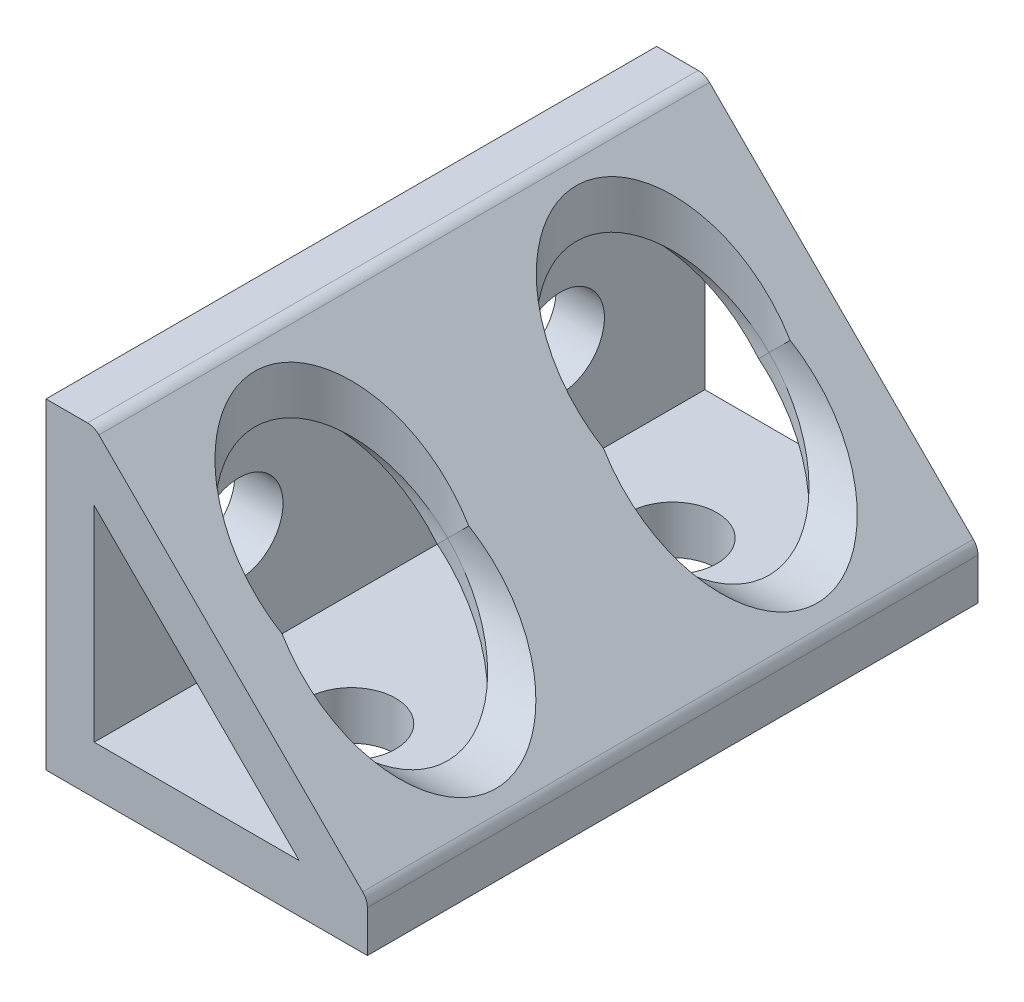
ISO-10303-21;
HEADER;
FILE_DESCRIPTION(('STEP AP214'),'2;1');
FILE_NAME('part.step','',(''),(''),'','','');
FILE_SCHEMA(('AUTOMOTIVE_DESIGN { 1 0 10303 214 1 1 1 1 }'));
ENDSEC;
DATA;
#1=APPLICATION_CONTEXT('core data for automotive mechanical design processes');
#2=APPLICATION_PROTOCOL_DEFINITION('international standard','automotive_design',2000,#1);
#3=PRODUCT_CONTEXT('',#1,'mechanical');
#4=PRODUCT('Part','Part','',(#3));
#5=PRODUCT_RELATED_PRODUCT_CATEGORY('part','',(#4));
#6=PRODUCT_DEFINITION_FORMATION('','',#4);
#7=PRODUCT_DEFINITION_CONTEXT('part definition',#1,'design');
#8=PRODUCT_DEFINITION('design','',#6,#7);
#9=PRODUCT_DEFINITION_SHAPE('','',#8);
#10=(LENGTH_UNIT() NAMED_UNIT(*) SI_UNIT(.MILLI.,.METRE.));
#11=(NAMED_UNIT(*) PLANE_ANGLE_UNIT() SI_UNIT($,.RADIAN.));
#12=(NAMED_UNIT(*) SI_UNIT($,.STERADIAN.) SOLID_ANGLE_UNIT());
#13=UNCERTAINTY_MEASURE_WITH_UNIT(LENGTH_MEASURE(1.E-05),#10,'distance_accuracy_value','');
#14=(GEOMETRIC_REPRESENTATION_CONTEXT(3) GLOBAL_UNCERTAINTY_ASSIGNED_CONTEXT((#13)) GLOBAL_UNIT_ASSIGNED_CONTEXT((#10,
#11,#12)) REPRESENTATION_CONTEXT('',''));
#15=CARTESIAN_POINT('',(0.,0.,0.));
#16=DIRECTION('',(0.,0.,1.));
#17=DIRECTION('',(1.,0.,0.));
#18=AXIS2_PLACEMENT_3D('',#15,#16,#17);
#19=CARTESIAN_POINT('',(0.,0.,19.));
#20=DIRECTION('',(0.,0.,-1.));
#21=DIRECTION('',(-1.,0.,0.));
#22=AXIS2_PLACEMENT_3D('',#19,#20,#21);
#23=PLANE('',#22);
#24=DIRECTION('',(-0.707106781186548,0.707106781186547,0.));
#25=VECTOR('',#24,1.);
#26=CARTESIAN_POINT('',(15.7573593128807,3.,19.));
#27=LINE('',#26,#25);
#28=CARTESIAN_POINT('',(15.7573593128807,2.99999999999999,19.));
#29=VERTEX_POINT('',#28);
#30=CARTESIAN_POINT('',(3.,15.7573593128807,19.));
#31=VERTEX_POINT('',#30);
#32=EDGE_CURVE('E326',#29,#31,#27,.T.);
#33=ORIENTED_EDGE('',*,*,#32,.F.);
#34=DIRECTION('',(-1.,0.,0.));
#35=VECTOR('',#34,1.);
#36=CARTESIAN_POINT('',(0.,2.99999999999999,19.));
#37=LINE('',#36,#35);
#38=CARTESIAN_POINT('',(3.,2.99999999999999,19.));
#39=VERTEX_POINT('',#38);
#40=EDGE_CURVE('E212',#29,#39,#37,.T.);
#41=ORIENTED_EDGE('',*,*,#40,.T.);
#42=DIRECTION('',(0.,1.,0.));
#43=VECTOR('',#42,1.);
#44=CARTESIAN_POINT('',(3.,20.,19.));
#45=LINE('',#44,#43);
#46=EDGE_CURVE('E219',#39,#31,#45,.T.);
#47=ORIENTED_EDGE('',*,*,#46,.T.);
#48=EDGE_LOOP('',(#33,#41,#47));
#49=FACE_BOUND('',#48,.T.);
#50=DIRECTION('',(0.,1.,0.));
#51=VECTOR('',#50,1.);
#52=CARTESIAN_POINT('',(20.,0.,19.));
#53=LINE('',#52,#51);
#54=CARTESIAN_POINT('',(20.,0.,19.));
#55=VERTEX_POINT('',#54);
#56=CARTESIAN_POINT('',(20.,2.58578643762691,19.));
#57=VERTEX_POINT('',#56);
#58=EDGE_CURVE('E198',#55,#57,#53,.T.);
#59=ORIENTED_EDGE('',*,*,#58,.T.);
#60=CARTESIAN_POINT('',(19.,2.58578643762691,19.));
#61=DIRECTION('',(0.,0.,-1.));
#62=DIRECTION('',(-1.,0.,0.));
#63=AXIS2_PLACEMENT_3D('',#60,#61,#62);
#64=CIRCLE('',#63,1.);
#65=CARTESIAN_POINT('',(19.7071067811865,3.29289321881346,19.));
#66=VERTEX_POINT('',#65);
#67=EDGE_CURVE('E296',#57,#66,#64,.F.);
#68=ORIENTED_EDGE('',*,*,#67,.T.);
#69=DIRECTION('',(0.707106781186547,-0.707106781186547,0.));
#70=VECTOR('',#69,1.);
#71=CARTESIAN_POINT('',(3.29289321881345,19.7071067811866,19.));
#72=LINE('',#71,#70);
#73=CARTESIAN_POINT('',(3.29289321881345,19.7071067811866,19.));
#74=VERTEX_POINT('',#73);
#75=EDGE_CURVE('E246',#74,#66,#72,.T.);
#76=ORIENTED_EDGE('',*,*,#75,.F.);
#77=CARTESIAN_POINT('',(2.5857864376269,19.,19.));
#78=DIRECTION('',(0.,0.,-1.));
#79=DIRECTION('',(-1.,0.,0.));
#80=AXIS2_PLACEMENT_3D('',#77,#78,#79);
#81=CIRCLE('',#80,1.);
#82=CARTESIAN_POINT('',(2.5857864376269,20.,19.));
#83=VERTEX_POINT('',#82);
#84=EDGE_CURVE('E294',#74,#83,#81,.F.);
#85=ORIENTED_EDGE('',*,*,#84,.T.);
#86=DIRECTION('',(1.,0.,0.));
#87=VECTOR('',#86,1.);
#88=CARTESIAN_POINT('',(0.,20.,19.));
#89=LINE('',#88,#87);
#90=CARTESIAN_POINT('',(0.,20.,19.));
#91=VERTEX_POINT('',#90);
#92=EDGE_CURVE('E237',#91,#83,#89,.T.);
#93=ORIENTED_EDGE('',*,*,#92,.F.);
#94=DIRECTION('',(0.,1.,0.));
#95=VECTOR('',#94,1.);
#96=CARTESIAN_POINT('',(0.,20.,19.));
#97=LINE('',#96,#95);
#98=CARTESIAN_POINT('',(0.,0.,19.));
#99=VERTEX_POINT('',#98);
#100=EDGE_CURVE('E224',#99,#91,#97,.T.);
#101=ORIENTED_EDGE('',*,*,#100,.F.);
#102=DIRECTION('',(-1.,0.,0.));
#103=VECTOR('',#102,1.);
#104=CARTESIAN_POINT('',(0.,0.,19.));
#105=LINE('',#104,#103);
#106=EDGE_CURVE('E202',#55,#99,#105,.T.);
#107=ORIENTED_EDGE('',*,*,#106,.F.);
#108=EDGE_LOOP('',(#59,#68,#76,#85,#93,#101,#107));
#109=FACE_BOUND('',#108,.T.);
#110=ADVANCED_FACE('F51',(#49,#109),#23,.F.);
#111=CARTESIAN_POINT('',(0.,0.,-19.));
#112=DIRECTION('',(0.,0.,-1.));
#113=DIRECTION('',(-1.,0.,0.));
#114=AXIS2_PLACEMENT_3D('',#111,#112,#113);
#115=PLANE('',#114);
#116=DIRECTION('',(0.707106781186547,-0.707106781186547,0.));
#117=VECTOR('',#116,1.);
#118=CARTESIAN_POINT('',(3.29289321881345,19.7071067811866,-19.));
#119=LINE('',#118,#117);
#120=CARTESIAN_POINT('',(3.29289321881345,19.7071067811866,-19.));
#121=VERTEX_POINT('',#120);
#122=CARTESIAN_POINT('',(19.7071067811865,3.29289321881346,-19.));
#123=VERTEX_POINT('',#122);
#124=EDGE_CURVE('E240',#121,#123,#119,.T.);
#125=ORIENTED_EDGE('',*,*,#124,.T.);
#126=CARTESIAN_POINT('',(19.,2.58578643762691,-19.));
#127=DIRECTION('',(0.,0.,-1.));
#128=DIRECTION('',(-1.,0.,0.));
#129=AXIS2_PLACEMENT_3D('',#126,#127,#128);
#130=CIRCLE('',#129,1.);
#131=CARTESIAN_POINT('',(20.,2.58578643762691,-19.));
#132=VERTEX_POINT('',#131);
#133=EDGE_CURVE('E59',#123,#132,#130,.T.);
#134=ORIENTED_EDGE('',*,*,#133,.T.);
#135=DIRECTION('',(0.,1.,0.));
#136=VECTOR('',#135,1.);
#137=CARTESIAN_POINT('',(20.,0.,-19.));
#138=LINE('',#137,#136);
#139=CARTESIAN_POINT('',(20.,0.,-19.));
#140=VERTEX_POINT('',#139);
#141=EDGE_CURVE('E195',#140,#132,#138,.T.);
#142=ORIENTED_EDGE('',*,*,#141,.F.);
#143=DIRECTION('',(1.,0.,0.));
#144=VECTOR('',#143,1.);
#145=CARTESIAN_POINT('',(20.,0.,-19.));
#146=LINE('',#145,#144);
#147=CARTESIAN_POINT('',(0.,0.,-19.));
#148=VERTEX_POINT('',#147);
#149=EDGE_CURVE('E203',#148,#140,#146,.T.);
#150=ORIENTED_EDGE('',*,*,#149,.F.);
#151=DIRECTION('',(0.,-1.,0.));
#152=VECTOR('',#151,1.);
#153=CARTESIAN_POINT('',(0.,2.99999999999999,-19.));
#154=LINE('',#153,#152);
#155=CARTESIAN_POINT('',(0.,20.,-19.));
#156=VERTEX_POINT('',#155);
#157=EDGE_CURVE('E229',#156,#148,#154,.T.);
#158=ORIENTED_EDGE('',*,*,#157,.F.);
#159=DIRECTION('',(1.,0.,0.));
#160=VECTOR('',#159,1.);
#161=CARTESIAN_POINT('',(0.,20.,-19.));
#162=LINE('',#161,#160);
#163=CARTESIAN_POINT('',(2.5857864376269,20.,-19.));
#164=VERTEX_POINT('',#163);
#165=EDGE_CURVE('E230',#156,#164,#162,.T.);
#166=ORIENTED_EDGE('',*,*,#165,.T.);
#167=CARTESIAN_POINT('',(2.5857864376269,19.,-19.));
#168=DIRECTION('',(0.,0.,-1.));
#169=DIRECTION('',(-1.,0.,0.));
#170=AXIS2_PLACEMENT_3D('',#167,#168,#169);
#171=CIRCLE('',#170,1.);
#172=EDGE_CURVE('E302',#164,#121,#171,.T.);
#173=ORIENTED_EDGE('',*,*,#172,.T.);
#174=EDGE_LOOP('',(#125,#134,#142,#150,#158,#166,#173));
#175=FACE_BOUND('',#174,.T.);
#176=DIRECTION('',(-0.707106781186548,0.707106781186547,0.));
#177=VECTOR('',#176,1.);
#178=CARTESIAN_POINT('',(15.7573593128807,3.,-19.));
#179=LINE('',#178,#177);
#180=CARTESIAN_POINT('',(15.7573593128807,3.,-19.));
#181=VERTEX_POINT('',#180);
#182=CARTESIAN_POINT('',(3.,15.7573593128807,-19.));
#183=VERTEX_POINT('',#182);
#184=EDGE_CURVE('E245',#181,#183,#179,.T.);
#185=ORIENTED_EDGE('',*,*,#184,.T.);
#186=DIRECTION('',(0.,-1.,0.));
#187=VECTOR('',#186,1.);
#188=CARTESIAN_POINT('',(3.,2.99999999999999,-19.));
#189=LINE('',#188,#187);
#190=CARTESIAN_POINT('',(3.,2.99999999999999,-19.));
#191=VERTEX_POINT('',#190);
#192=EDGE_CURVE('E227',#183,#191,#189,.T.);
#193=ORIENTED_EDGE('',*,*,#192,.T.);
#194=DIRECTION('',(1.,0.,0.));
#195=VECTOR('',#194,1.);
#196=CARTESIAN_POINT('',(20.,2.99999999999999,-19.));
#197=LINE('',#196,#195);
#198=EDGE_CURVE('E318',#191,#181,#197,.T.);
#199=ORIENTED_EDGE('',*,*,#198,.T.);
#200=EDGE_LOOP('',(#185,#193,#199));
#201=FACE_BOUND('',#200,.T.);
#202=ADVANCED_FACE('F214',(#175,#201),#115,.T.);
#203=CARTESIAN_POINT('',(10.,20.,10.));
#204=DIRECTION('',(0.,-1.,0.));
#205=DIRECTION('',(1.,0.,0.));
#206=AXIS2_PLACEMENT_3D('',#203,#204,#205);
#207=CYLINDRICAL_SURFACE('',#206,6.);
#208=CARTESIAN_POINT('',(10.,10.,10.));
#209=DIRECTION('',(-0.707106781186548,-0.707106781186547,0.));
#210=DIRECTION('',(0.707106781186547,-0.707106781186548,0.));
#211=AXIS2_PLACEMENT_3D('',#208,#209,#210);
#212=ELLIPSE('',#211,8.48528137423857,6.);
#213=CARTESIAN_POINT('',(10.,10.,16.));
#214=VERTEX_POINT('',#213);
#215=CARTESIAN_POINT('',(10.,10.,4.));
#216=VERTEX_POINT('',#215);
#217=EDGE_CURVE('E412',#214,#216,#212,.F.);
#218=ORIENTED_EDGE('',*,*,#217,.T.);
#219=CARTESIAN_POINT('',(10.,10.,10.));
#220=DIRECTION('',(0.707106781186547,-0.707106781186548,0.));
#221=DIRECTION('',(-0.707106781186548,-0.707106781186547,0.));
#222=AXIS2_PLACEMENT_3D('',#219,#220,#221);
#223=ELLIPSE('',#222,8.48528137423857,6.);
#224=CARTESIAN_POINT('',(9.37867965644037,9.37867965644034,4.03225662157973));
#225=VERTEX_POINT('',#224);
#226=EDGE_CURVE('E284',#216,#225,#223,.F.);
#227=ORIENTED_EDGE('',*,*,#226,.T.);
#228=CARTESIAN_POINT('',(10.,8.75735931288071,10.));
#229=DIRECTION('',(0.707106781186547,0.707106781186548,0.));
#230=DIRECTION('',(0.707106781186548,-0.707106781186547,0.));
#231=AXIS2_PLACEMENT_3D('',#228,#229,#230);
#232=ELLIPSE('',#231,8.48528137423857,6.);
#233=CARTESIAN_POINT('',(15.7573593128807,2.99999999999999,8.31097254540202));
#234=VERTEX_POINT('',#233);
#235=EDGE_CURVE('E277',#225,#234,#232,.F.);
#236=ORIENTED_EDGE('',*,*,#235,.T.);
#237=CARTESIAN_POINT('',(10.,3.,10.));
#238=DIRECTION('',(0.,-1.,0.));
#239=DIRECTION('',(1.,0.,0.));
#240=AXIS2_PLACEMENT_3D('',#237,#238,#239);
#241=CIRCLE('',#240,6.);
#242=CARTESIAN_POINT('',(15.7573593128807,2.99999999999999,11.689027454598));
#243=VERTEX_POINT('',#242);
#244=EDGE_CURVE('E239',#243,#234,#241,.F.);
#245=ORIENTED_EDGE('',*,*,#244,.F.);
#246=CARTESIAN_POINT('',(10.,8.75735931288071,10.));
#247=DIRECTION('',(0.707106781186547,0.707106781186548,0.));
#248=DIRECTION('',(0.707106781186548,-0.707106781186547,0.));
#249=AXIS2_PLACEMENT_3D('',#246,#247,#248);
#250=ELLIPSE('',#249,8.48528137423857,6.);
#251=CARTESIAN_POINT('',(9.37867965644038,9.37867965644033,15.9677433784203));
#252=VERTEX_POINT('',#251);
#253=EDGE_CURVE('E349',#243,#252,#250,.F.);
#254=ORIENTED_EDGE('',*,*,#253,.T.);
#255=CARTESIAN_POINT('',(10.,10.,10.));
#256=DIRECTION('',(0.707106781186547,-0.707106781186548,0.));
#257=DIRECTION('',(-0.707106781186548,-0.707106781186547,0.));
#258=AXIS2_PLACEMENT_3D('',#255,#256,#257);
#259=ELLIPSE('',#258,8.48528137423857,6.);
#260=EDGE_CURVE('E287',#252,#214,#259,.F.);
#261=ORIENTED_EDGE('',*,*,#260,.T.);
#262=EDGE_LOOP('',(#218,#227,#236,#245,#254,#261));
#263=FACE_BOUND('',#262,.T.);
#264=ADVANCED_FACE('F463',(#263),#207,.F.);
#265=CARTESIAN_POINT('',(20.,10.,10.));
#266=DIRECTION('',(-1.,0.,0.));
#267=DIRECTION('',(0.,-1.,0.));
#268=AXIS2_PLACEMENT_3D('',#265,#266,#267);
#269=CYLINDRICAL_SURFACE('',#268,6.);
#270=ORIENTED_EDGE('',*,*,#226,.F.);
#271=CARTESIAN_POINT('',(10.,10.,10.));
#272=DIRECTION('',(-0.707106781186548,-0.707106781186547,0.));
#273=DIRECTION('',(-0.707106781186547,0.707106781186548,0.));
#274=AXIS2_PLACEMENT_3D('',#271,#272,#273);
#275=ELLIPSE('',#274,8.48528137423857,6.);
#276=EDGE_CURVE('E423',#216,#214,#275,.F.);
#277=ORIENTED_EDGE('',*,*,#276,.T.);
#278=ORIENTED_EDGE('',*,*,#260,.F.);
#279=CARTESIAN_POINT('',(8.75735931288071,10.,10.));
#280=DIRECTION('',(0.707106781186547,0.707106781186548,0.));
#281=DIRECTION('',(-0.707106781186548,0.707106781186547,0.));
#282=AXIS2_PLACEMENT_3D('',#279,#280,#281);
#283=ELLIPSE('',#282,8.48528137423857,6.);
#284=CARTESIAN_POINT('',(3.,15.7573593128807,11.689027454598));
#285=VERTEX_POINT('',#284);
#286=EDGE_CURVE('E341',#252,#285,#283,.F.);
#287=ORIENTED_EDGE('',*,*,#286,.T.);
#288=CARTESIAN_POINT('',(3.,10.,10.));
#289=DIRECTION('',(-1.,0.,0.));
#290=DIRECTION('',(0.,-1.,0.));
#291=AXIS2_PLACEMENT_3D('',#288,#289,#290);
#292=CIRCLE('',#291,6.);
#293=CARTESIAN_POINT('',(3.,15.7573593128807,8.31097254540202));
#294=VERTEX_POINT('',#293);
#295=EDGE_CURVE('E336',#285,#294,#292,.T.);
#296=ORIENTED_EDGE('',*,*,#295,.T.);
#297=CARTESIAN_POINT('',(8.75735931288071,10.,10.));
#298=DIRECTION('',(0.707106781186547,0.707106781186548,0.));
#299=DIRECTION('',(-0.707106781186548,0.707106781186547,0.));
#300=AXIS2_PLACEMENT_3D('',#297,#298,#299);
#301=ELLIPSE('',#300,8.48528137423857,6.);
#302=EDGE_CURVE('E280',#294,#225,#301,.F.);
#303=ORIENTED_EDGE('',*,*,#302,.T.);
#304=EDGE_LOOP('',(#270,#277,#278,#287,#296,#303));
#305=FACE_BOUND('',#304,.T.);
#306=ADVANCED_FACE('F466',(#305),#269,.F.);
#307=CARTESIAN_POINT('',(3.,15.7573593128807,-19.));
#308=DIRECTION('',(0.707106781186547,0.707106781186548,0.));
#309=DIRECTION('',(-0.707106781186548,0.707106781186547,0.));
#310=AXIS2_PLACEMENT_3D('',#307,#308,#309);
#311=PLANE('',#310);
#312=CARTESIAN_POINT('',(10.,8.75735931288071,-10.));
#313=DIRECTION('',(0.707106781186547,0.707106781186548,0.));
#314=DIRECTION('',(0.707106781186548,-0.707106781186547,0.));
#315=AXIS2_PLACEMENT_3D('',#312,#313,#314);
#316=ELLIPSE('',#315,8.48528137423857,6.);
#317=CARTESIAN_POINT('',(15.7573593128807,2.99999999999999,-8.31097254540202));
#318=VERTEX_POINT('',#317);
#319=CARTESIAN_POINT('',(9.37867965644038,9.37867965644033,-4.03225662157974));
#320=VERTEX_POINT('',#319);
#321=EDGE_CURVE('E273',#318,#320,#316,.F.);
#322=ORIENTED_EDGE('',*,*,#321,.F.);
#323=DIRECTION('',(0.,0.,1.));
#324=VECTOR('',#323,1.);
#325=CARTESIAN_POINT('',(15.7573593128807,3.,-19.));
#326=LINE('',#325,#324);
#327=EDGE_CURVE('E388',#318,#234,#326,.T.);
#328=ORIENTED_EDGE('',*,*,#327,.T.);
#329=ORIENTED_EDGE('',*,*,#235,.F.);
#330=ORIENTED_EDGE('',*,*,#302,.F.);
#331=DIRECTION('',(0.,0.,1.));
#332=VECTOR('',#331,1.);
#333=CARTESIAN_POINT('',(3.,15.7573593128807,-19.));
#334=LINE('',#333,#332);
#335=CARTESIAN_POINT('',(3.,15.7573593128807,-8.31097254540201));
#336=VERTEX_POINT('',#335);
#337=EDGE_CURVE('E347',#294,#336,#334,.F.);
#338=ORIENTED_EDGE('',*,*,#337,.T.);
#339=CARTESIAN_POINT('',(8.75735931288071,10.,-10.));
#340=DIRECTION('',(0.707106781186547,0.707106781186548,0.));
#341=DIRECTION('',(-0.707106781186548,0.707106781186547,0.));
#342=AXIS2_PLACEMENT_3D('',#339,#340,#341);
#343=ELLIPSE('',#342,8.48528137423857,6.);
#344=EDGE_CURVE('E266',#336,#320,#343,.T.);
#345=ORIENTED_EDGE('',*,*,#344,.T.);
#346=EDGE_LOOP('',(#322,#328,#329,#330,#338,#345));
#347=FACE_BOUND('',#346,.T.);
#348=ADVANCED_FACE('F472',(#347),#311,.F.);
#349=CARTESIAN_POINT('',(10.,20.,-10.));
#350=DIRECTION('',(0.,-1.,0.));
#351=DIRECTION('',(1.,0.,0.));
#352=AXIS2_PLACEMENT_3D('',#349,#350,#351);
#353=CYLINDRICAL_SURFACE('',#352,6.);
#354=CARTESIAN_POINT('',(10.,10.,-10.));
#355=DIRECTION('',(-0.707106781186548,-0.707106781186547,0.));
#356=DIRECTION('',(0.707106781186547,-0.707106781186548,0.));
#357=AXIS2_PLACEMENT_3D('',#354,#355,#356);
#358=ELLIPSE('',#357,8.48528137423857,6.);
#359=CARTESIAN_POINT('',(10.,10.,-4.));
#360=VERTEX_POINT('',#359);
#361=CARTESIAN_POINT('',(10.,10.,-16.));
#362=VERTEX_POINT('',#361);
#363=EDGE_CURVE('E397',#360,#362,#358,.F.);
#364=ORIENTED_EDGE('',*,*,#363,.T.);
#365=CARTESIAN_POINT('',(10.,10.,-10.));
#366=DIRECTION('',(0.707106781186547,-0.707106781186548,0.));
#367=DIRECTION('',(-0.707106781186548,-0.707106781186547,0.));
#368=AXIS2_PLACEMENT_3D('',#365,#366,#367);
#369=ELLIPSE('',#368,8.48528137423857,6.);
#370=CARTESIAN_POINT('',(9.37867965644037,9.37867965644034,-15.9677433784203));
#371=VERTEX_POINT('',#370);
#372=EDGE_CURVE('E426',#362,#371,#369,.F.);
#373=ORIENTED_EDGE('',*,*,#372,.T.);
#374=CARTESIAN_POINT('',(10.,8.75735931288071,-10.));
#375=DIRECTION('',(0.707106781186547,0.707106781186548,0.));
#376=DIRECTION('',(0.707106781186548,-0.707106781186547,0.));
#377=AXIS2_PLACEMENT_3D('',#374,#375,#376);
#378=ELLIPSE('',#377,8.48528137423857,6.);
#379=CARTESIAN_POINT('',(15.7573593128807,2.99999999999999,-11.689027454598));
#380=VERTEX_POINT('',#379);
#381=EDGE_CURVE('E380',#371,#380,#378,.F.);
#382=ORIENTED_EDGE('',*,*,#381,.T.);
#383=CARTESIAN_POINT('',(10.,3.,-10.));
#384=DIRECTION('',(0.,-1.,0.));
#385=DIRECTION('',(1.,0.,0.));
#386=AXIS2_PLACEMENT_3D('',#383,#384,#385);
#387=CIRCLE('',#386,6.);
#388=EDGE_CURVE('E384',#380,#318,#387,.T.);
#389=ORIENTED_EDGE('',*,*,#388,.T.);
#390=ORIENTED_EDGE('',*,*,#321,.T.);
#391=CARTESIAN_POINT('',(10.,10.,-10.));
#392=DIRECTION('',(0.707106781186547,-0.707106781186548,0.));
#393=DIRECTION('',(-0.707106781186548,-0.707106781186547,0.));
#394=AXIS2_PLACEMENT_3D('',#391,#392,#393);
#395=ELLIPSE('',#394,8.48528137423857,6.);
#396=EDGE_CURVE('E272',#320,#360,#395,.F.);
#397=ORIENTED_EDGE('',*,*,#396,.T.);
#398=EDGE_LOOP('',(#364,#373,#382,#389,#390,#397));
#399=FACE_BOUND('',#398,.T.);
#400=ADVANCED_FACE('F436',(#399),#353,.F.);
#401=CARTESIAN_POINT('',(20.,10.,-10.));
#402=DIRECTION('',(-1.,0.,0.));
#403=DIRECTION('',(0.,-1.,0.));
#404=AXIS2_PLACEMENT_3D('',#401,#402,#403);
#405=CYLINDRICAL_SURFACE('',#404,6.);
#406=ORIENTED_EDGE('',*,*,#372,.F.);
#407=CARTESIAN_POINT('',(10.,10.,-10.));
#408=DIRECTION('',(-0.707106781186548,-0.707106781186547,0.));
#409=DIRECTION('',(-0.707106781186547,0.707106781186548,0.));
#410=AXIS2_PLACEMENT_3D('',#407,#408,#409);
#411=ELLIPSE('',#410,8.48528137423857,6.);
#412=EDGE_CURVE('E408',#362,#360,#411,.F.);
#413=ORIENTED_EDGE('',*,*,#412,.T.);
#414=ORIENTED_EDGE('',*,*,#396,.F.);
#415=ORIENTED_EDGE('',*,*,#344,.F.);
#416=CARTESIAN_POINT('',(3.,10.,-10.));
#417=DIRECTION('',(-1.,0.,0.));
#418=DIRECTION('',(0.,-1.,0.));
#419=AXIS2_PLACEMENT_3D('',#416,#417,#418);
#420=CIRCLE('',#419,6.);
#421=CARTESIAN_POINT('',(3.,15.7573593128807,-11.689027454598));
#422=VERTEX_POINT('',#421);
#423=EDGE_CURVE('E389',#336,#422,#420,.T.);
#424=ORIENTED_EDGE('',*,*,#423,.T.);
#425=CARTESIAN_POINT('',(8.75735931288071,10.,-10.));
#426=DIRECTION('',(0.707106781186547,0.707106781186548,0.));
#427=DIRECTION('',(-0.707106781186548,0.707106781186547,0.));
#428=AXIS2_PLACEMENT_3D('',#425,#426,#427);
#429=ELLIPSE('',#428,8.48528137423857,6.);
#430=EDGE_CURVE('E375',#422,#371,#429,.F.);
#431=ORIENTED_EDGE('',*,*,#430,.T.);
#432=EDGE_LOOP('',(#406,#413,#414,#415,#424,#431));
#433=FACE_BOUND('',#432,.T.);
#434=ADVANCED_FACE('F442',(#433),#405,.F.);
#435=CARTESIAN_POINT('',(10.,20.,10.));
#436=DIRECTION('',(0.,-1.,0.));
#437=DIRECTION('',(1.,0.,0.));
#438=AXIS2_PLACEMENT_3D('',#435,#436,#437);
#439=CYLINDRICAL_SURFACE('',#438,6.);
#440=ORIENTED_EDGE('',*,*,#276,.F.);
#441=CARTESIAN_POINT('',(10.,10.,10.));
#442=DIRECTION('',(0.707106781186547,-0.707106781186548,0.));
#443=DIRECTION('',(-0.707106781186548,-0.707106781186547,0.));
#444=AXIS2_PLACEMENT_3D('',#441,#442,#443);
#445=ELLIPSE('',#444,8.48528137423857,6.);
#446=CARTESIAN_POINT('',(11.5,11.5,4.19052498068887));
#447=VERTEX_POINT('',#446);
#448=EDGE_CURVE('E419',#216,#447,#445,.T.);
#449=ORIENTED_EDGE('',*,*,#448,.T.);
#450=CARTESIAN_POINT('',(10.,13.,10.));
#451=DIRECTION('',(0.707106781186548,0.707106781186548,0.));
#452=DIRECTION('',(0.707106781186548,-0.707106781186548,0.));
#453=AXIS2_PLACEMENT_3D('',#450,#451,#452);
#454=ELLIPSE('',#453,8.48528137423857,6.);
#455=CARTESIAN_POINT('',(11.5,11.5,15.8094750193111));
#456=VERTEX_POINT('',#455);
#457=EDGE_CURVE('E371',#456,#447,#454,.F.);
#458=ORIENTED_EDGE('',*,*,#457,.F.);
#459=CARTESIAN_POINT('',(10.,10.,10.));
#460=DIRECTION('',(0.707106781186547,-0.707106781186548,0.));
#461=DIRECTION('',(-0.707106781186548,-0.707106781186547,0.));
#462=AXIS2_PLACEMENT_3D('',#459,#460,#461);
#463=ELLIPSE('',#462,8.48528137423857,6.);
#464=EDGE_CURVE('E415',#456,#214,#463,.T.);
#465=ORIENTED_EDGE('',*,*,#464,.T.);
#466=EDGE_LOOP('',(#440,#449,#458,#465));
#467=FACE_BOUND('',#466,.T.);
#468=ADVANCED_FACE('F456',(#467),#439,.F.);
#469=CARTESIAN_POINT('',(20.,10.,10.));
#470=DIRECTION('',(-1.,0.,0.));
#471=DIRECTION('',(0.,-1.,0.));
#472=AXIS2_PLACEMENT_3D('',#469,#470,#471);
#473=CYLINDRICAL_SURFACE('',#472,6.);
#474=CARTESIAN_POINT('',(13.,10.,10.));
#475=DIRECTION('',(0.707106781186548,0.707106781186548,0.));
#476=DIRECTION('',(-0.707106781186548,0.707106781186548,0.));
#477=AXIS2_PLACEMENT_3D('',#474,#475,#476);
#478=ELLIPSE('',#477,8.48528137423857,6.);
#479=EDGE_CURVE('E367',#447,#456,#478,.F.);
#480=ORIENTED_EDGE('',*,*,#479,.F.);
#481=ORIENTED_EDGE('',*,*,#448,.F.);
#482=ORIENTED_EDGE('',*,*,#217,.F.);
#483=ORIENTED_EDGE('',*,*,#464,.F.);
#484=EDGE_LOOP('',(#480,#481,#482,#483));
#485=FACE_BOUND('',#484,.T.);
#486=ADVANCED_FACE('F460',(#485),#473,.F.);
#487=CARTESIAN_POINT('',(10.,20.,-10.));
#488=DIRECTION('',(0.,-1.,0.));
#489=DIRECTION('',(1.,0.,0.));
#490=AXIS2_PLACEMENT_3D('',#487,#488,#489);
#491=CYLINDRICAL_SURFACE('',#490,6.);
#492=ORIENTED_EDGE('',*,*,#412,.F.);
#493=CARTESIAN_POINT('',(10.,10.,-10.));
#494=DIRECTION('',(0.707106781186547,-0.707106781186548,0.));
#495=DIRECTION('',(-0.707106781186548,-0.707106781186547,0.));
#496=AXIS2_PLACEMENT_3D('',#493,#494,#495);
#497=ELLIPSE('',#496,8.48528137423857,6.);
#498=CARTESIAN_POINT('',(11.5,11.5,-15.8094750193111));
#499=VERTEX_POINT('',#498);
#500=EDGE_CURVE('E404',#362,#499,#497,.T.);
#501=ORIENTED_EDGE('',*,*,#500,.T.);
#502=CARTESIAN_POINT('',(10.,13.,-10.));
#503=DIRECTION('',(0.707106781186548,0.707106781186548,0.));
#504=DIRECTION('',(0.707106781186548,-0.707106781186548,0.));
#505=AXIS2_PLACEMENT_3D('',#502,#503,#504);
#506=ELLIPSE('',#505,8.48528137423857,6.);
#507=CARTESIAN_POINT('',(11.5,11.5,-4.19052498068887));
#508=VERTEX_POINT('',#507);
#509=EDGE_CURVE('E363',#508,#499,#506,.F.);
#510=ORIENTED_EDGE('',*,*,#509,.F.);
#511=CARTESIAN_POINT('',(10.,10.,-10.));
#512=DIRECTION('',(0.707106781186547,-0.707106781186548,0.));
#513=DIRECTION('',(-0.707106781186548,-0.707106781186547,0.));
#514=AXIS2_PLACEMENT_3D('',#511,#512,#513);
#515=ELLIPSE('',#514,8.48528137423857,6.);
#516=EDGE_CURVE('E400',#508,#360,#515,.T.);
#517=ORIENTED_EDGE('',*,*,#516,.T.);
#518=EDGE_LOOP('',(#492,#501,#510,#517));
#519=FACE_BOUND('',#518,.T.);
#520=ADVANCED_FACE('F446',(#519),#491,.F.);
#521=CARTESIAN_POINT('',(20.,10.,-10.));
#522=DIRECTION('',(-1.,0.,0.));
#523=DIRECTION('',(0.,-1.,0.));
#524=AXIS2_PLACEMENT_3D('',#521,#522,#523);
#525=CYLINDRICAL_SURFACE('',#524,6.);
#526=CARTESIAN_POINT('',(13.,10.,-10.));
#527=DIRECTION('',(0.707106781186548,0.707106781186548,0.));
#528=DIRECTION('',(-0.707106781186548,0.707106781186548,0.));
#529=AXIS2_PLACEMENT_3D('',#526,#527,#528);
#530=ELLIPSE('',#529,8.48528137423857,6.);
#531=EDGE_CURVE('E359',#499,#508,#530,.F.);
#532=ORIENTED_EDGE('',*,*,#531,.F.);
#533=ORIENTED_EDGE('',*,*,#500,.F.);
#534=ORIENTED_EDGE('',*,*,#363,.F.);
#535=ORIENTED_EDGE('',*,*,#516,.F.);
#536=EDGE_LOOP('',(#532,#533,#534,#535));
#537=FACE_BOUND('',#536,.T.);
#538=ADVANCED_FACE('F448',(#537),#525,.F.);
#539=CARTESIAN_POINT('',(3.,15.7573593128807,-19.));
#540=DIRECTION('',(0.707106781186547,0.707106781186548,0.));
#541=DIRECTION('',(-0.707106781186548,0.707106781186547,0.));
#542=AXIS2_PLACEMENT_3D('',#539,#540,#541);
#543=PLANE('',#542);
#544=ORIENTED_EDGE('',*,*,#253,.F.);
#545=DIRECTION('',(0.,0.,1.));
#546=VECTOR('',#545,1.);
#547=CARTESIAN_POINT('',(15.7573593128807,3.,-19.));
#548=LINE('',#547,#546);
#549=EDGE_CURVE('E383',#243,#29,#548,.T.);
#550=ORIENTED_EDGE('',*,*,#549,.T.);
#551=ORIENTED_EDGE('',*,*,#32,.T.);
#552=DIRECTION('',(0.,0.,1.));
#553=VECTOR('',#552,1.);
#554=CARTESIAN_POINT('',(3.,15.7573593128807,-19.));
#555=LINE('',#554,#553);
#556=EDGE_CURVE('E334',#31,#285,#555,.F.);
#557=ORIENTED_EDGE('',*,*,#556,.T.);
#558=ORIENTED_EDGE('',*,*,#286,.F.);
#559=EDGE_LOOP('',(#544,#550,#551,#557,#558));
#560=FACE_BOUND('',#559,.T.);
#561=ADVANCED_FACE('F475',(#560),#543,.F.);
#562=CARTESIAN_POINT('',(3.,15.7573593128807,-19.));
#563=DIRECTION('',(0.707106781186547,0.707106781186548,0.));
#564=DIRECTION('',(-0.707106781186548,0.707106781186547,0.));
#565=AXIS2_PLACEMENT_3D('',#562,#563,#564);
#566=PLANE('',#565);
#567=DIRECTION('',(0.,0.,1.));
#568=VECTOR('',#567,1.);
#569=CARTESIAN_POINT('',(3.,15.7573593128807,-19.));
#570=LINE('',#569,#568);
#571=EDGE_CURVE('E379',#183,#422,#570,.T.);
#572=ORIENTED_EDGE('',*,*,#571,.F.);
#573=ORIENTED_EDGE('',*,*,#184,.F.);
#574=DIRECTION('',(0.,0.,1.));
#575=VECTOR('',#574,1.);
#576=CARTESIAN_POINT('',(15.7573593128807,3.,-19.));
#577=LINE('',#576,#575);
#578=EDGE_CURVE('E382',#380,#181,#577,.F.);
#579=ORIENTED_EDGE('',*,*,#578,.F.);
#580=ORIENTED_EDGE('',*,*,#381,.F.);
#581=ORIENTED_EDGE('',*,*,#430,.F.);
#582=EDGE_LOOP('',(#572,#573,#579,#580,#581));
#583=FACE_BOUND('',#582,.T.);
#584=ADVANCED_FACE('F451',(#583),#566,.F.);
#585=CARTESIAN_POINT('',(3.,20.,-19.));
#586=DIRECTION('',(0.707106781186548,0.707106781186548,0.));
#587=DIRECTION('',(-0.707106781186548,0.707106781186548,0.));
#588=AXIS2_PLACEMENT_3D('',#585,#586,#587);
#589=PLANE('',#588);
#590=ORIENTED_EDGE('',*,*,#75,.T.);
#591=DIRECTION('',(0.,0.,1.));
#592=VECTOR('',#591,1.);
#593=CARTESIAN_POINT('',(19.7071067811865,3.29289321881345,-19.));
#594=LINE('',#593,#592);
#595=EDGE_CURVE('E72',#66,#123,#594,.F.);
#596=ORIENTED_EDGE('',*,*,#595,.T.);
#597=ORIENTED_EDGE('',*,*,#124,.F.);
#598=DIRECTION('',(0.,0.,1.));
#599=VECTOR('',#598,1.);
#600=CARTESIAN_POINT('',(3.29289321881345,19.7071067811865,19.));
#601=LINE('',#600,#599);
#602=EDGE_CURVE('E298',#121,#74,#601,.T.);
#603=ORIENTED_EDGE('',*,*,#602,.T.);
#604=EDGE_LOOP('',(#590,#596,#597,#603));
#605=FACE_BOUND('',#604,.T.);
#606=ORIENTED_EDGE('',*,*,#509,.T.);
#607=ORIENTED_EDGE('',*,*,#531,.T.);
#608=EDGE_LOOP('',(#606,#607));
#609=FACE_BOUND('',#608,.T.);
#610=ORIENTED_EDGE('',*,*,#457,.T.);
#611=ORIENTED_EDGE('',*,*,#479,.T.);
#612=EDGE_LOOP('',(#610,#611));
#613=FACE_BOUND('',#612,.T.);
#614=ADVANCED_FACE('F306',(#605,#609,#613),#589,.T.);
#615=CARTESIAN_POINT('',(3.,0.,0.));
#616=DIRECTION('',(1.,0.,0.));
#617=DIRECTION('',(0.,0.,-1.));
#618=AXIS2_PLACEMENT_3D('',#615,#616,#617);
#619=PLANE('',#618);
#620=CARTESIAN_POINT('',(3.,10.,10.));
#621=DIRECTION('',(-1.,0.,0.));
#622=DIRECTION('',(0.,0.,1.));
#623=AXIS2_PLACEMENT_3D('',#620,#621,#622);
#624=CIRCLE('',#623,2.74999999999999);
#625=CARTESIAN_POINT('',(3.,10.,12.75));
#626=VERTEX_POINT('',#625);
#627=EDGE_CURVE('E648',#626,#626,#624,.T.);
#628=ORIENTED_EDGE('',*,*,#627,.T.);
#629=EDGE_LOOP('',(#628));
#630=FACE_BOUND('',#629,.T.);
#631=CARTESIAN_POINT('',(3.,10.,-10.));
#632=DIRECTION('',(-1.,0.,0.));
#633=DIRECTION('',(0.,0.,1.));
#634=AXIS2_PLACEMENT_3D('',#631,#632,#633);
#635=CIRCLE('',#634,2.74999999999999);
#636=CARTESIAN_POINT('',(3.,10.,-7.25000000000001));
#637=VERTEX_POINT('',#636);
#638=EDGE_CURVE('E663',#637,#637,#635,.T.);
#639=ORIENTED_EDGE('',*,*,#638,.T.);
#640=EDGE_LOOP('',(#639));
#641=FACE_BOUND('',#640,.T.);
#642=ORIENTED_EDGE('',*,*,#556,.F.);
#643=ORIENTED_EDGE('',*,*,#46,.F.);
#644=DIRECTION('',(0.,0.,1.));
#645=VECTOR('',#644,1.);
#646=CARTESIAN_POINT('',(3.,2.99999999999999,19.));
#647=LINE('',#646,#645);
#648=EDGE_CURVE('E217',#191,#39,#647,.T.);
#649=ORIENTED_EDGE('',*,*,#648,.F.);
#650=ORIENTED_EDGE('',*,*,#192,.F.);
#651=ORIENTED_EDGE('',*,*,#571,.T.);
#652=ORIENTED_EDGE('',*,*,#423,.F.);
#653=ORIENTED_EDGE('',*,*,#337,.F.);
#654=ORIENTED_EDGE('',*,*,#295,.F.);
#655=EDGE_LOOP('',(#642,#643,#649,#650,#651,#652,#653,#654));
#656=FACE_BOUND('',#655,.T.);
#657=ADVANCED_FACE('F332',(#630,#641,#656),#619,.T.);
#658=CARTESIAN_POINT('',(0.,20.,-19.));
#659=DIRECTION('',(0.,-1.,0.));
#660=DIRECTION('',(0.,0.,-1.));
#661=AXIS2_PLACEMENT_3D('',#658,#659,#660);
#662=PLANE('',#661);
#663=ORIENTED_EDGE('',*,*,#92,.T.);
#664=DIRECTION('',(0.,0.,1.));
#665=VECTOR('',#664,1.);
#666=CARTESIAN_POINT('',(2.5857864376269,20.,-19.));
#667=LINE('',#666,#665);
#668=EDGE_CURVE('E12',#83,#164,#667,.F.);
#669=ORIENTED_EDGE('',*,*,#668,.T.);
#670=ORIENTED_EDGE('',*,*,#165,.F.);
#671=DIRECTION('',(0.,0.,-1.));
#672=VECTOR('',#671,1.);
#673=CARTESIAN_POINT('',(0.,20.,-19.));
#674=LINE('',#673,#672);
#675=EDGE_CURVE('E226',#91,#156,#674,.T.);
#676=ORIENTED_EDGE('',*,*,#675,.F.);
#677=EDGE_LOOP('',(#663,#669,#670,#676));
#678=FACE_BOUND('',#677,.T.);
#679=ADVANCED_FACE('F312',(#678),#662,.F.);
#680=CARTESIAN_POINT('',(0.,0.,0.));
#681=DIRECTION('',(1.,0.,0.));
#682=DIRECTION('',(0.,0.,-1.));
#683=AXIS2_PLACEMENT_3D('',#680,#681,#682);
#684=PLANE('',#683);
#685=CARTESIAN_POINT('',(0.,10.,10.));
#686=DIRECTION('',(-1.,0.,0.));
#687=DIRECTION('',(0.,0.,1.));
#688=AXIS2_PLACEMENT_3D('',#685,#686,#687);
#689=CIRCLE('',#688,2.74999999999999);
#690=CARTESIAN_POINT('',(0.,10.,12.75));
#691=VERTEX_POINT('',#690);
#692=EDGE_CURVE('E651',#691,#691,#689,.T.);
#693=ORIENTED_EDGE('',*,*,#692,.F.);
#694=EDGE_LOOP('',(#693));
#695=FACE_BOUND('',#694,.T.);
#696=CARTESIAN_POINT('',(0.,10.,-10.));
#697=DIRECTION('',(-1.,0.,0.));
#698=DIRECTION('',(0.,0.,1.));
#699=AXIS2_PLACEMENT_3D('',#696,#697,#698);
#700=CIRCLE('',#699,2.74999999999999);
#701=CARTESIAN_POINT('',(0.,10.,-7.25000000000001));
#702=VERTEX_POINT('',#701);
#703=EDGE_CURVE('E654',#702,#702,#700,.T.);
#704=ORIENTED_EDGE('',*,*,#703,.F.);
#705=EDGE_LOOP('',(#704));
#706=FACE_BOUND('',#705,.T.);
#707=ORIENTED_EDGE('',*,*,#157,.T.);
#708=DIRECTION('',(0.,0.,-1.));
#709=VECTOR('',#708,1.);
#710=CARTESIAN_POINT('',(0.,0.,-19.));
#711=LINE('',#710,#709);
#712=EDGE_CURVE('E209',#99,#148,#711,.T.);
#713=ORIENTED_EDGE('',*,*,#712,.F.);
#714=ORIENTED_EDGE('',*,*,#100,.T.);
#715=ORIENTED_EDGE('',*,*,#675,.T.);
#716=EDGE_LOOP('',(#707,#713,#714,#715));
#717=FACE_BOUND('',#716,.T.);
#718=ADVANCED_FACE('F314',(#695,#706,#717),#684,.F.);
#719=CARTESIAN_POINT('',(0.,2.99999999999999,0.));
#720=DIRECTION('',(0.,1.,0.));
#721=DIRECTION('',(0.,0.,1.));
#722=AXIS2_PLACEMENT_3D('',#719,#720,#721);
#723=PLANE('',#722);
#724=CARTESIAN_POINT('',(10.,3.,-10.));
#725=DIRECTION('',(0.,-1.,0.));
#726=DIRECTION('',(0.,0.,-1.));
#727=AXIS2_PLACEMENT_3D('',#724,#725,#726);
#728=CIRCLE('',#727,2.7499999999998);
#729=CARTESIAN_POINT('',(10.,3.,-12.7499999999998));
#730=VERTEX_POINT('',#729);
#731=EDGE_CURVE('E652',#730,#730,#728,.T.);
#732=ORIENTED_EDGE('',*,*,#731,.T.);
#733=EDGE_LOOP('',(#732));
#734=FACE_BOUND('',#733,.T.);
#735=CARTESIAN_POINT('',(10.,2.99999999999999,10.));
#736=DIRECTION('',(0.,1.,0.));
#737=DIRECTION('',(0.,0.,1.));
#738=AXIS2_PLACEMENT_3D('',#735,#736,#737);
#739=CIRCLE('',#738,2.74999999999998);
#740=CARTESIAN_POINT('',(10.,2.99999999999999,12.75));
#741=VERTEX_POINT('',#740);
#742=EDGE_CURVE('E666',#741,#741,#739,.T.);
#743=ORIENTED_EDGE('',*,*,#742,.F.);
#744=EDGE_LOOP('',(#743));
#745=FACE_BOUND('',#744,.T.);
#746=ORIENTED_EDGE('',*,*,#549,.F.);
#747=ORIENTED_EDGE('',*,*,#244,.T.);
#748=ORIENTED_EDGE('',*,*,#327,.F.);
#749=ORIENTED_EDGE('',*,*,#388,.F.);
#750=ORIENTED_EDGE('',*,*,#578,.T.);
#751=ORIENTED_EDGE('',*,*,#198,.F.);
#752=ORIENTED_EDGE('',*,*,#648,.T.);
#753=ORIENTED_EDGE('',*,*,#40,.F.);
#754=EDGE_LOOP('',(#746,#747,#748,#749,#750,#751,#752,#753));
#755=FACE_BOUND('',#754,.T.);
#756=ADVANCED_FACE('F476',(#734,#745,#755),#723,.T.);
#757=CARTESIAN_POINT('',(20.,0.,19.));
#758=DIRECTION('',(-1.,0.,0.));
#759=DIRECTION('',(0.,0.,1.));
#760=AXIS2_PLACEMENT_3D('',#757,#758,#759);
#761=PLANE('',#760);
#762=ORIENTED_EDGE('',*,*,#141,.T.);
#763=DIRECTION('',(0.,0.,1.));
#764=VECTOR('',#763,1.);
#765=CARTESIAN_POINT('',(20.,2.58578643762691,19.));
#766=LINE('',#765,#764);
#767=EDGE_CURVE('E244',#132,#57,#766,.T.);
#768=ORIENTED_EDGE('',*,*,#767,.T.);
#769=ORIENTED_EDGE('',*,*,#58,.F.);
#770=DIRECTION('',(0.,0.,1.));
#771=VECTOR('',#770,1.);
#772=CARTESIAN_POINT('',(20.,0.,19.));
#773=LINE('',#772,#771);
#774=EDGE_CURVE('E190',#140,#55,#773,.T.);
#775=ORIENTED_EDGE('',*,*,#774,.F.);
#776=EDGE_LOOP('',(#762,#768,#769,#775));
#777=FACE_BOUND('',#776,.T.);
#778=ADVANCED_FACE('F192',(#777),#761,.F.);
#779=CARTESIAN_POINT('',(0.,0.,0.));
#780=DIRECTION('',(0.,1.,0.));
#781=DIRECTION('',(0.,0.,1.));
#782=AXIS2_PLACEMENT_3D('',#779,#780,#781);
#783=PLANE('',#782);
#784=CARTESIAN_POINT('',(10.,0.,-10.));
#785=DIRECTION('',(0.,-1.,0.));
#786=DIRECTION('',(0.,0.,-1.));
#787=AXIS2_PLACEMENT_3D('',#784,#785,#786);
#788=CIRCLE('',#787,2.7499999999998);
#789=CARTESIAN_POINT('',(10.,0.,-12.7499999999998));
#790=VERTEX_POINT('',#789);
#791=EDGE_CURVE('E657',#790,#790,#788,.T.);
#792=ORIENTED_EDGE('',*,*,#791,.F.);
#793=EDGE_LOOP('',(#792));
#794=FACE_BOUND('',#793,.T.);
#795=CARTESIAN_POINT('',(10.,0.,10.));
#796=DIRECTION('',(0.,1.,0.));
#797=DIRECTION('',(0.,0.,1.));
#798=AXIS2_PLACEMENT_3D('',#795,#796,#797);
#799=CIRCLE('',#798,2.74999999999998);
#800=CARTESIAN_POINT('',(10.,0.,12.75));
#801=VERTEX_POINT('',#800);
#802=EDGE_CURVE('E320',#801,#801,#799,.T.);
#803=ORIENTED_EDGE('',*,*,#802,.T.);
#804=EDGE_LOOP('',(#803));
#805=FACE_BOUND('',#804,.T.);
#806=ORIENTED_EDGE('',*,*,#149,.T.);
#807=ORIENTED_EDGE('',*,*,#774,.T.);
#808=ORIENTED_EDGE('',*,*,#106,.T.);
#809=ORIENTED_EDGE('',*,*,#712,.T.);
#810=EDGE_LOOP('',(#806,#807,#808,#809));
#811=FACE_BOUND('',#810,.T.);
#812=ADVANCED_FACE('F207',(#794,#805,#811),#783,.F.);
#813=CARTESIAN_POINT('',(10.,2.99999999999999,10.));
#814=DIRECTION('',(0.,1.,0.));
#815=DIRECTION('',(0.,0.,1.));
#816=AXIS2_PLACEMENT_3D('',#813,#814,#815);
#817=CYLINDRICAL_SURFACE('',#816,2.74999999999998);
#818=ORIENTED_EDGE('',*,*,#802,.F.);
#819=EDGE_LOOP('',(#818));
#820=FACE_BOUND('',#819,.T.);
#821=ORIENTED_EDGE('',*,*,#742,.T.);
#822=EDGE_LOOP('',(#821));
#823=FACE_BOUND('',#822,.T.);
#824=ADVANCED_FACE('F632',(#820,#823),#817,.F.);
#825=CARTESIAN_POINT('',(0.,10.,-10.));
#826=DIRECTION('',(-1.,0.,0.));
#827=DIRECTION('',(0.,0.,1.));
#828=AXIS2_PLACEMENT_3D('',#825,#826,#827);
#829=CYLINDRICAL_SURFACE('',#828,2.74999999999999);
#830=ORIENTED_EDGE('',*,*,#638,.F.);
#831=EDGE_LOOP('',(#830));
#832=FACE_BOUND('',#831,.T.);
#833=ORIENTED_EDGE('',*,*,#703,.T.);
#834=EDGE_LOOP('',(#833));
#835=FACE_BOUND('',#834,.T.);
#836=ADVANCED_FACE('F636',(#832,#835),#829,.F.);
#837=CARTESIAN_POINT('',(0.,10.,10.));
#838=DIRECTION('',(-1.,0.,0.));
#839=DIRECTION('',(0.,0.,1.));
#840=AXIS2_PLACEMENT_3D('',#837,#838,#839);
#841=CYLINDRICAL_SURFACE('',#840,2.74999999999999);
#842=ORIENTED_EDGE('',*,*,#627,.F.);
#843=EDGE_LOOP('',(#842));
#844=FACE_BOUND('',#843,.T.);
#845=ORIENTED_EDGE('',*,*,#692,.T.);
#846=EDGE_LOOP('',(#845));
#847=FACE_BOUND('',#846,.T.);
#848=ADVANCED_FACE('F591',(#844,#847),#841,.F.);
#849=CARTESIAN_POINT('',(10.,0.,-10.));
#850=DIRECTION('',(0.,-1.,0.));
#851=DIRECTION('',(0.,0.,-1.));
#852=AXIS2_PLACEMENT_3D('',#849,#850,#851);
#853=CYLINDRICAL_SURFACE('',#852,2.7499999999998);
#854=ORIENTED_EDGE('',*,*,#731,.F.);
#855=EDGE_LOOP('',(#854));
#856=FACE_BOUND('',#855,.T.);
#857=ORIENTED_EDGE('',*,*,#791,.T.);
#858=EDGE_LOOP('',(#857));
#859=FACE_BOUND('',#858,.T.);
#860=ADVANCED_FACE('F586',(#856,#859),#853,.F.);
#861=CARTESIAN_POINT('',(19.,2.58578643762691,19.));
#862=DIRECTION('',(0.,0.,-1.));
#863=DIRECTION('',(-1.,0.,0.));
#864=AXIS2_PLACEMENT_3D('',#861,#862,#863);
#865=CYLINDRICAL_SURFACE('',#864,1.);
#866=ORIENTED_EDGE('',*,*,#133,.F.);
#867=ORIENTED_EDGE('',*,*,#595,.F.);
#868=ORIENTED_EDGE('',*,*,#67,.F.);
#869=ORIENTED_EDGE('',*,*,#767,.F.);
#870=EDGE_LOOP('',(#866,#867,#868,#869));
#871=FACE_BOUND('',#870,.T.);
#872=ADVANCED_FACE('F584',(#871),#865,.T.);
#873=CARTESIAN_POINT('',(2.5857864376269,19.,-19.));
#874=DIRECTION('',(0.,0.,-1.));
#875=DIRECTION('',(-1.,0.,0.));
#876=AXIS2_PLACEMENT_3D('',#873,#874,#875);
#877=CYLINDRICAL_SURFACE('',#876,1.);
#878=ORIENTED_EDGE('',*,*,#172,.F.);
#879=ORIENTED_EDGE('',*,*,#668,.F.);
#880=ORIENTED_EDGE('',*,*,#84,.F.);
#881=ORIENTED_EDGE('',*,*,#602,.F.);
#882=EDGE_LOOP('',(#878,#879,#880,#881));
#883=FACE_BOUND('',#882,.T.);
#884=ADVANCED_FACE('F53',(#883),#877,.T.);
#885=CLOSED_SHELL('',(#110,#202,#264,#306,#348,#400,#434,#468,#486,#520,#538,#561,#584,#614,
#657,#679,#718,#756,#778,#812,#824,#836,#848,#860,#872,#884));
#886=MANIFOLD_SOLID_BREP('B2',#885);
#887=ADVANCED_BREP_SHAPE_REPRESENTATION('',(#18,#886),#14);
#888=SHAPE_DEFINITION_REPRESENTATION(#9,#887);
ENDSEC;
END-ISO-10303-21;
